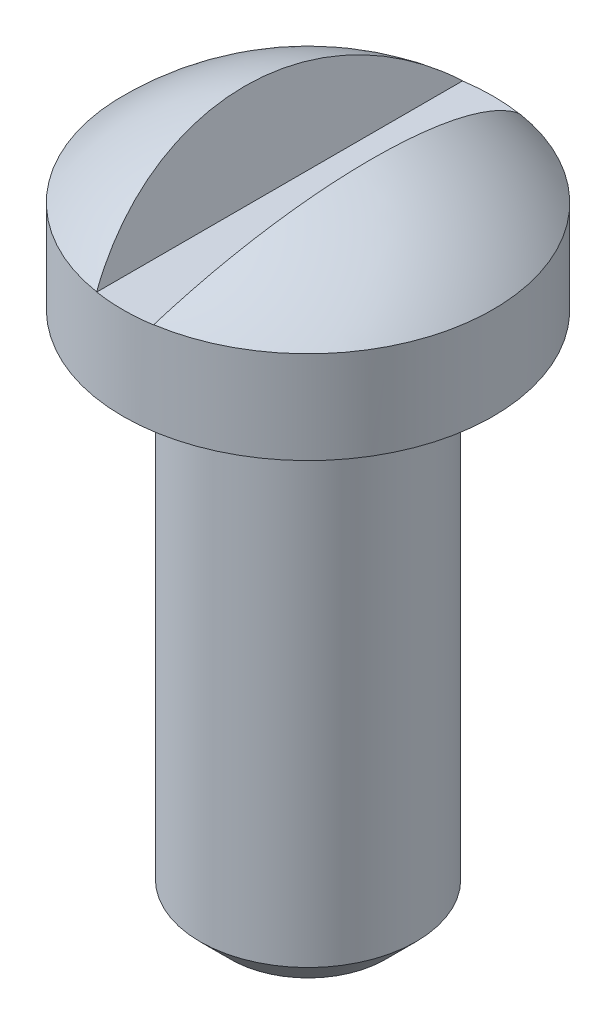
ISO-10303-21;
HEADER;
FILE_DESCRIPTION(('STEP AP214'),'2;1');
FILE_NAME('part.step','',(''),(''),'','','');
FILE_SCHEMA(('AUTOMOTIVE_DESIGN { 1 0 10303 214 1 1 1 1 }'));
ENDSEC;
DATA;
#1=APPLICATION_CONTEXT('core data for automotive mechanical design processes');
#2=APPLICATION_PROTOCOL_DEFINITION('international standard','automotive_design',2000,#1);
#3=PRODUCT_CONTEXT('',#1,'mechanical');
#4=PRODUCT('Part','Part','',(#3));
#5=PRODUCT_RELATED_PRODUCT_CATEGORY('part','',(#4));
#6=PRODUCT_DEFINITION_FORMATION('','',#4);
#7=PRODUCT_DEFINITION_CONTEXT('part definition',#1,'design');
#8=PRODUCT_DEFINITION('design','',#6,#7);
#9=PRODUCT_DEFINITION_SHAPE('','',#8);
#10=(LENGTH_UNIT() NAMED_UNIT(*) SI_UNIT(.MILLI.,.METRE.));
#11=(NAMED_UNIT(*) PLANE_ANGLE_UNIT() SI_UNIT($,.RADIAN.));
#12=(NAMED_UNIT(*) SI_UNIT($,.STERADIAN.) SOLID_ANGLE_UNIT());
#13=UNCERTAINTY_MEASURE_WITH_UNIT(LENGTH_MEASURE(1.E-05),#10,'distance_accuracy_value','');
#14=(GEOMETRIC_REPRESENTATION_CONTEXT(3) GLOBAL_UNCERTAINTY_ASSIGNED_CONTEXT((#13)) GLOBAL_UNIT_ASSIGNED_CONTEXT((#10,
#11,#12)) REPRESENTATION_CONTEXT('',''));
#15=CARTESIAN_POINT('',(0.,0.,0.));
#16=DIRECTION('',(0.,0.,1.));
#17=DIRECTION('',(1.,0.,0.));
#18=AXIS2_PLACEMENT_3D('',#15,#16,#17);
#19=CARTESIAN_POINT('',(0.,-25.732100586485,0.));
#20=DIRECTION('',(0.,1.,0.));
#21=DIRECTION('',(0.,0.,1.));
#22=AXIS2_PLACEMENT_3D('',#19,#20,#21);
#23=CYLINDRICAL_SURFACE('',#22,15.24);
#24=CARTESIAN_POINT('',(0.,-45.2277559455014,0.));
#25=DIRECTION('',(0.,1.,0.));
#26=DIRECTION('',(0.,0.,1.));
#27=AXIS2_PLACEMENT_3D('',#24,#25,#26);
#28=CIRCLE('',#27,15.24);
#29=CARTESIAN_POINT('',(0.,-45.2277559455014,15.24));
#30=VERTEX_POINT('',#29);
#31=EDGE_CURVE('E129',#30,#30,#28,.T.);
#32=ORIENTED_EDGE('',*,*,#31,.T.);
#33=EDGE_LOOP('',(#32));
#34=FACE_BOUND('',#33,.T.);
#35=CARTESIAN_POINT('',(0.,-37.6258560929857,0.));
#36=DIRECTION('',(0.,1.,0.));
#37=DIRECTION('',(0.,0.,1.));
#38=AXIS2_PLACEMENT_3D('',#35,#36,#37);
#39=CIRCLE('',#38,15.24);
#40=CARTESIAN_POINT('',(2.34072728175166,-37.6258560929857,15.0591698241458));
#41=VERTEX_POINT('',#40);
#42=CARTESIAN_POINT('',(-2.34072728175166,-37.6258560929857,15.0591698241458));
#43=VERTEX_POINT('',#42);
#44=EDGE_CURVE('E11',#41,#43,#39,.F.);
#45=ORIENTED_EDGE('',*,*,#44,.T.);
#46=CARTESIAN_POINT('',(0.,-42.2925494188012,0.));
#47=DIRECTION('',(0.893861000876187,0.448344188222198,0.));
#48=DIRECTION('',(-0.448344188222198,0.893861000876187,0.));
#49=AXIS2_PLACEMENT_3D('',#46,#47,#48);
#50=ELLIPSE('',#49,33.9917420596676,15.24);
#51=CARTESIAN_POINT('',(-2.34980598182091,-37.6077559455014,15.0577558702417));
#52=VERTEX_POINT('',#51);
#53=EDGE_CURVE('E104',#43,#52,#50,.F.);
#54=ORIENTED_EDGE('',*,*,#53,.T.);
#55=CARTESIAN_POINT('',(0.,-37.6077559455014,0.));
#56=DIRECTION('',(0.,1.,0.));
#57=DIRECTION('',(0.,0.,1.));
#58=AXIS2_PLACEMENT_3D('',#55,#56,#57);
#59=CIRCLE('',#58,15.24);
#60=CARTESIAN_POINT('',(-2.34980598182091,-37.6077559455014,-15.0577558702417));
#61=VERTEX_POINT('',#60);
#62=EDGE_CURVE('E128',#61,#52,#59,.T.);
#63=ORIENTED_EDGE('',*,*,#62,.F.);
#64=CARTESIAN_POINT('',(-2.34072728175166,-37.6258560929857,-15.0591698241458));
#65=VERTEX_POINT('',#64);
#66=EDGE_CURVE('E108',#61,#65,#50,.F.);
#67=ORIENTED_EDGE('',*,*,#66,.T.);
#68=CARTESIAN_POINT('',(2.34072728175166,-37.6258560929857,-15.0591698241458));
#69=VERTEX_POINT('',#68);
#70=EDGE_CURVE('E48',#65,#69,#39,.F.);
#71=ORIENTED_EDGE('',*,*,#70,.T.);
#72=CARTESIAN_POINT('',(0.,-42.2925494188012,0.));
#73=DIRECTION('',(-0.893861000876187,0.448344188222198,0.));
#74=DIRECTION('',(0.448344188222198,0.893861000876187,0.));
#75=AXIS2_PLACEMENT_3D('',#72,#73,#74);
#76=ELLIPSE('',#75,33.9917420596676,15.24);
#77=CARTESIAN_POINT('',(2.34980598182091,-37.6077559455014,-15.0577558702417));
#78=VERTEX_POINT('',#77);
#79=EDGE_CURVE('E97',#69,#78,#76,.F.);
#80=ORIENTED_EDGE('',*,*,#79,.T.);
#81=CARTESIAN_POINT('',(2.34980598182091,-37.6077559455014,15.0577558702417));
#82=VERTEX_POINT('',#81);
#83=EDGE_CURVE('E102',#82,#78,#59,.T.);
#84=ORIENTED_EDGE('',*,*,#83,.F.);
#85=EDGE_CURVE('E61',#82,#41,#76,.F.);
#86=ORIENTED_EDGE('',*,*,#85,.T.);
#87=EDGE_LOOP('',(#45,#54,#63,#67,#71,#80,#84,#86));
#88=FACE_BOUND('',#87,.T.);
#89=ADVANCED_FACE('F44',(#34,#88),#23,.T.);
#90=CARTESIAN_POINT('',(0.,-52.7207559455014,0.));
#91=DIRECTION('',(0.,0.,1.));
#92=DIRECTION('',(1.,0.,0.));
#93=AXIS2_PLACEMENT_3D('',#90,#91,#92);
#94=SPHERICAL_SURFACE('',#93,21.463);
#95=CARTESIAN_POINT('',(4.17918077601691,-50.6245559651683,0.));
#96=DIRECTION('',(0.893861000876187,0.448344188222198,0.));
#97=DIRECTION('',(-0.448344188222198,0.893861000876187,0.));
#98=AXIS2_PLACEMENT_3D('',#95,#96,#97);
#99=CIRCLE('',#98,20.9475717610376);
#100=EDGE_CURVE('E68',#52,#61,#99,.F.);
#101=ORIENTED_EDGE('',*,*,#100,.T.);
#102=ORIENTED_EDGE('',*,*,#62,.T.);
#103=EDGE_LOOP('',(#101,#102));
#104=FACE_BOUND('',#103,.T.);
#105=ADVANCED_FACE('F46',(#104),#94,.T.);
#106=ORIENTED_EDGE('',*,*,#83,.T.);
#107=CARTESIAN_POINT('',(-4.17918077601691,-50.6245559651683,0.));
#108=DIRECTION('',(-0.893861000876187,0.448344188222198,0.));
#109=DIRECTION('',(-0.448344188222198,-0.893861000876187,0.));
#110=AXIS2_PLACEMENT_3D('',#107,#108,#109);
#111=CIRCLE('',#110,20.9475717610376);
#112=EDGE_CURVE('E145',#78,#82,#111,.F.);
#113=ORIENTED_EDGE('',*,*,#112,.T.);
#114=EDGE_LOOP('',(#106,#113));
#115=FACE_BOUND('',#114,.T.);
#116=ADVANCED_FACE('F159',(#115),#94,.T.);
#117=CARTESIAN_POINT('',(-6.34999999999999,-88.4077559455014,0.));
#118=DIRECTION('',(0.,-1.,0.));
#119=DIRECTION('',(0.,0.,-1.));
#120=AXIS2_PLACEMENT_3D('',#117,#118,#119);
#121=PLANE('',#120);
#122=CARTESIAN_POINT('',(0.,-88.4077559455014,0.));
#123=DIRECTION('',(0.,-1.,0.));
#124=DIRECTION('',(0.,0.,-1.));
#125=AXIS2_PLACEMENT_3D('',#122,#123,#124);
#126=CIRCLE('',#125,6.34999999999998);
#127=CARTESIAN_POINT('',(0.,-88.4077559455014,-6.34999999999998));
#128=VERTEX_POINT('',#127);
#129=EDGE_CURVE('E141',#128,#128,#126,.T.);
#130=ORIENTED_EDGE('',*,*,#129,.T.);
#131=EDGE_LOOP('',(#130));
#132=FACE_BOUND('',#131,.T.);
#133=ADVANCED_FACE('F164',(#132),#121,.T.);
#134=CARTESIAN_POINT('',(0.,-25.732100586485,0.));
#135=DIRECTION('',(0.,1.,0.));
#136=DIRECTION('',(0.,0.,1.));
#137=AXIS2_PLACEMENT_3D('',#134,#135,#136);
#138=CYLINDRICAL_SURFACE('',#137,8.89);
#139=CARTESIAN_POINT('',(0.,-85.8677559455014,0.));
#140=DIRECTION('',(0.,-1.,0.));
#141=DIRECTION('',(0.,0.,-1.));
#142=AXIS2_PLACEMENT_3D('',#139,#140,#141);
#143=CIRCLE('',#142,8.89);
#144=CARTESIAN_POINT('',(0.,-85.8677559455014,-8.89));
#145=VERTEX_POINT('',#144);
#146=EDGE_CURVE('E137',#145,#145,#143,.F.);
#147=ORIENTED_EDGE('',*,*,#146,.T.);
#148=EDGE_LOOP('',(#147));
#149=FACE_BOUND('',#148,.T.);
#150=CARTESIAN_POINT('',(0.,-45.2277559455014,0.));
#151=DIRECTION('',(0.,1.,0.));
#152=DIRECTION('',(0.,0.,1.));
#153=AXIS2_PLACEMENT_3D('',#150,#151,#152);
#154=CIRCLE('',#153,8.89);
#155=CARTESIAN_POINT('',(0.,-45.2277559455014,8.89));
#156=VERTEX_POINT('',#155);
#157=EDGE_CURVE('E133',#156,#156,#154,.T.);
#158=ORIENTED_EDGE('',*,*,#157,.F.);
#159=EDGE_LOOP('',(#158));
#160=FACE_BOUND('',#159,.T.);
#161=ADVANCED_FACE('F178',(#149,#160),#138,.T.);
#162=CARTESIAN_POINT('',(-12.7,-45.2277559455014,0.));
#163=DIRECTION('',(0.,-1.,0.));
#164=DIRECTION('',(0.,0.,-1.));
#165=AXIS2_PLACEMENT_3D('',#162,#163,#164);
#166=PLANE('',#165);
#167=ORIENTED_EDGE('',*,*,#157,.T.);
#168=EDGE_LOOP('',(#167));
#169=FACE_BOUND('',#168,.T.);
#170=ORIENTED_EDGE('',*,*,#31,.F.);
#171=EDGE_LOOP('',(#170));
#172=FACE_BOUND('',#171,.T.);
#173=ADVANCED_FACE('F174',(#169,#172),#166,.T.);
#174=CARTESIAN_POINT('',(0.,-85.8677559455014,0.));
#175=DIRECTION('',(0.,1.,0.));
#176=DIRECTION('',(0.,0.,1.));
#177=AXIS2_PLACEMENT_3D('',#174,#175,#176);
#178=CONICAL_SURFACE('',#177,8.89,0.785398163397451);
#179=ORIENTED_EDGE('',*,*,#129,.F.);
#180=EDGE_LOOP('',(#179));
#181=FACE_BOUND('',#180,.T.);
#182=ORIENTED_EDGE('',*,*,#146,.F.);
#183=EDGE_LOOP('',(#182));
#184=FACE_BOUND('',#183,.T.);
#185=ADVANCED_FACE('F177',(#181,#184),#178,.T.);
#186=CARTESIAN_POINT('',(-2.34072728175166,-37.6258560929857,97.4167512611163));
#187=DIRECTION('',(0.893861000876187,0.448344188222198,0.));
#188=DIRECTION('',(-0.448344188222198,0.893861000876187,0.));
#189=AXIS2_PLACEMENT_3D('',#186,#187,#188);
#190=PLANE('',#189);
#191=ORIENTED_EDGE('',*,*,#66,.F.);
#192=ORIENTED_EDGE('',*,*,#100,.F.);
#193=ORIENTED_EDGE('',*,*,#53,.F.);
#194=DIRECTION('',(0.,0.,-1.));
#195=VECTOR('',#194,1.);
#196=CARTESIAN_POINT('',(-2.34072728175166,-37.6258560929857,97.4167512611163));
#197=LINE('',#196,#195);
#198=EDGE_CURVE('E92',#43,#65,#197,.T.);
#199=ORIENTED_EDGE('',*,*,#198,.T.);
#200=EDGE_LOOP('',(#191,#192,#193,#199));
#201=FACE_BOUND('',#200,.T.);
#202=ADVANCED_FACE('F154',(#201),#190,.T.);
#203=CARTESIAN_POINT('',(2.34072728175166,-37.6258560929857,97.4167512611163));
#204=DIRECTION('',(0.,1.,0.));
#205=DIRECTION('',(0.,0.,1.));
#206=AXIS2_PLACEMENT_3D('',#203,#204,#205);
#207=PLANE('',#206);
#208=ORIENTED_EDGE('',*,*,#70,.F.);
#209=ORIENTED_EDGE('',*,*,#198,.F.);
#210=ORIENTED_EDGE('',*,*,#44,.F.);
#211=DIRECTION('',(0.,0.,-1.));
#212=VECTOR('',#211,1.);
#213=CARTESIAN_POINT('',(2.34072728175166,-37.6258560929857,97.4167512611163));
#214=LINE('',#213,#212);
#215=EDGE_CURVE('E89',#41,#69,#214,.T.);
#216=ORIENTED_EDGE('',*,*,#215,.T.);
#217=EDGE_LOOP('',(#208,#209,#210,#216));
#218=FACE_BOUND('',#217,.T.);
#219=ADVANCED_FACE('F88',(#218),#207,.T.);
#220=CARTESIAN_POINT('',(2.34072728175166,-37.6258560929857,97.4167512611163));
#221=DIRECTION('',(-0.893861000876187,0.448344188222198,0.));
#222=DIRECTION('',(-0.448344188222198,-0.893861000876187,0.));
#223=AXIS2_PLACEMENT_3D('',#220,#221,#222);
#224=PLANE('',#223);
#225=ORIENTED_EDGE('',*,*,#85,.F.);
#226=ORIENTED_EDGE('',*,*,#112,.F.);
#227=ORIENTED_EDGE('',*,*,#79,.F.);
#228=ORIENTED_EDGE('',*,*,#215,.F.);
#229=EDGE_LOOP('',(#225,#226,#227,#228));
#230=FACE_BOUND('',#229,.T.);
#231=ADVANCED_FACE('F95',(#230),#224,.T.);
#232=CLOSED_SHELL('',(#89,#105,#116,#133,#161,#173,#185,#202,#219,#231));
#233=CARTESIAN_POINT('',(-12.7,-40.1477559455014,0.));
#234=DIRECTION('',(0.,1.,0.));
#235=DIRECTION('',(0.,0.,1.));
#236=AXIS2_PLACEMENT_3D('',#233,#234,#235);
#237=PLANE('',#236);
#238=CARTESIAN_POINT('',(0.,-40.1477559455014,0.));
#239=DIRECTION('',(0.,1.,0.));
#240=DIRECTION('',(0.,0.,1.));
#241=AXIS2_PLACEMENT_3D('',#238,#239,#240);
#242=CIRCLE('',#241,12.7);
#243=CARTESIAN_POINT('',(0.,-40.1477559455014,12.7));
#244=VERTEX_POINT('',#243);
#245=EDGE_CURVE('E124',#244,#244,#242,.T.);
#246=ORIENTED_EDGE('',*,*,#245,.F.);
#247=EDGE_LOOP('',(#246));
#248=FACE_BOUND('',#247,.T.);
#249=ADVANCED_FACE('F172',(#248),#237,.F.);
#250=CARTESIAN_POINT('',(0.,-25.732100586485,0.));
#251=DIRECTION('',(0.,1.,0.));
#252=DIRECTION('',(0.,0.,1.));
#253=AXIS2_PLACEMENT_3D('',#250,#251,#252);
#254=CYLINDRICAL_SURFACE('',#253,12.7);
#255=CARTESIAN_POINT('',(0.,-42.6877559455014,0.));
#256=DIRECTION('',(0.,1.,0.));
#257=DIRECTION('',(0.,0.,1.));
#258=AXIS2_PLACEMENT_3D('',#255,#256,#257);
#259=CIRCLE('',#258,12.7);
#260=CARTESIAN_POINT('',(0.,-42.6877559455014,12.7));
#261=VERTEX_POINT('',#260);
#262=EDGE_CURVE('E120',#261,#261,#259,.T.);
#263=ORIENTED_EDGE('',*,*,#262,.F.);
#264=EDGE_LOOP('',(#263));
#265=FACE_BOUND('',#264,.T.);
#266=ORIENTED_EDGE('',*,*,#245,.T.);
#267=EDGE_LOOP('',(#266));
#268=FACE_BOUND('',#267,.T.);
#269=ADVANCED_FACE('F218',(#265,#268),#254,.F.);
#270=CARTESIAN_POINT('',(-12.7,-42.6877559455014,0.));
#271=DIRECTION('',(0.,-1.,0.));
#272=DIRECTION('',(0.,0.,-1.));
#273=AXIS2_PLACEMENT_3D('',#270,#271,#272);
#274=PLANE('',#273);
#275=CARTESIAN_POINT('',(0.,-42.6877559455014,0.));
#276=DIRECTION('',(0.,1.,0.));
#277=DIRECTION('',(0.,0.,1.));
#278=AXIS2_PLACEMENT_3D('',#275,#276,#277);
#279=CIRCLE('',#278,6.35);
#280=CARTESIAN_POINT('',(0.,-42.6877559455014,6.35));
#281=VERTEX_POINT('',#280);
#282=EDGE_CURVE('E116',#281,#281,#279,.T.);
#283=ORIENTED_EDGE('',*,*,#282,.F.);
#284=EDGE_LOOP('',(#283));
#285=FACE_BOUND('',#284,.T.);
#286=ORIENTED_EDGE('',*,*,#262,.T.);
#287=EDGE_LOOP('',(#286));
#288=FACE_BOUND('',#287,.T.);
#289=ADVANCED_FACE('F215',(#285,#288),#274,.F.);
#290=CARTESIAN_POINT('',(0.,-25.732100586485,0.));
#291=DIRECTION('',(0.,1.,0.));
#292=DIRECTION('',(0.,0.,1.));
#293=AXIS2_PLACEMENT_3D('',#290,#291,#292);
#294=CYLINDRICAL_SURFACE('',#293,6.35);
#295=CARTESIAN_POINT('',(0.,-85.8677559455014,0.));
#296=DIRECTION('',(0.,1.,0.));
#297=DIRECTION('',(0.,0.,1.));
#298=AXIS2_PLACEMENT_3D('',#295,#296,#297);
#299=CIRCLE('',#298,6.34999999999999);
#300=CARTESIAN_POINT('',(0.,-85.8677559455014,6.34999999999999));
#301=VERTEX_POINT('',#300);
#302=EDGE_CURVE('E112',#301,#301,#299,.T.);
#303=ORIENTED_EDGE('',*,*,#302,.F.);
#304=EDGE_LOOP('',(#303));
#305=FACE_BOUND('',#304,.T.);
#306=ORIENTED_EDGE('',*,*,#282,.T.);
#307=EDGE_LOOP('',(#306));
#308=FACE_BOUND('',#307,.T.);
#309=ADVANCED_FACE('F210',(#305,#308),#294,.F.);
#310=CARTESIAN_POINT('',(-6.34999999999999,-85.8677559455014,0.));
#311=DIRECTION('',(0.,-1.,0.));
#312=DIRECTION('',(0.,0.,-1.));
#313=AXIS2_PLACEMENT_3D('',#310,#311,#312);
#314=PLANE('',#313);
#315=ORIENTED_EDGE('',*,*,#302,.T.);
#316=EDGE_LOOP('',(#315));
#317=FACE_BOUND('',#316,.T.);
#318=ADVANCED_FACE('F207',(#317),#314,.F.);
#319=CLOSED_SHELL('',(#249,#269,#289,#309,#318));
#320=ORIENTED_CLOSED_SHELL('',*,#319,.T.);
#321=BREP_WITH_VOIDS('B2',#232,(#320));
#322=ADVANCED_BREP_SHAPE_REPRESENTATION('',(#18,#321),#14);
#323=SHAPE_DEFINITION_REPRESENTATION(#9,#322);
ENDSEC;
END-ISO-10303-21;
